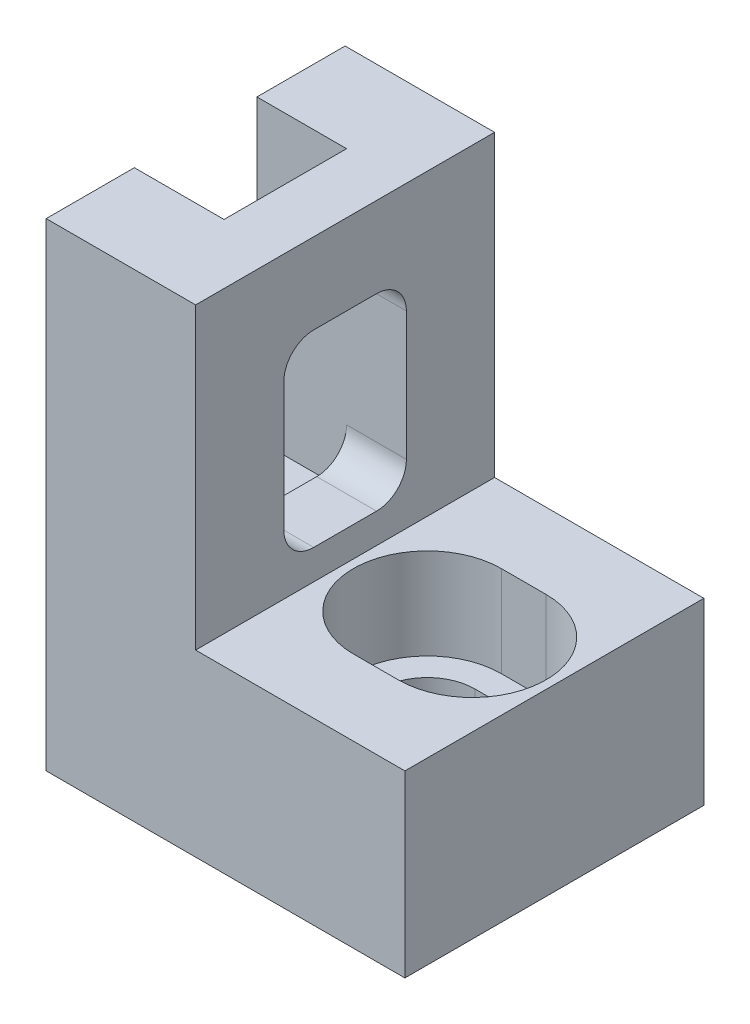
ISO-10303-21;
HEADER;
FILE_DESCRIPTION(('STEP AP214'),'2;1');
FILE_NAME('part.step','',(''),(''),'','','');
FILE_SCHEMA(('AUTOMOTIVE_DESIGN { 1 0 10303 214 1 1 1 1 }'));
ENDSEC;
DATA;
#1=APPLICATION_CONTEXT('core data for automotive mechanical design processes');
#2=APPLICATION_PROTOCOL_DEFINITION('international standard','automotive_design',2000,#1);
#3=PRODUCT_CONTEXT('',#1,'mechanical');
#4=PRODUCT('Part','Part','',(#3));
#5=PRODUCT_RELATED_PRODUCT_CATEGORY('part','',(#4));
#6=PRODUCT_DEFINITION_FORMATION('','',#4);
#7=PRODUCT_DEFINITION_CONTEXT('part definition',#1,'design');
#8=PRODUCT_DEFINITION('design','',#6,#7);
#9=PRODUCT_DEFINITION_SHAPE('','',#8);
#10=(LENGTH_UNIT() NAMED_UNIT(*) SI_UNIT(.MILLI.,.METRE.));
#11=(NAMED_UNIT(*) PLANE_ANGLE_UNIT() SI_UNIT($,.RADIAN.));
#12=(NAMED_UNIT(*) SI_UNIT($,.STERADIAN.) SOLID_ANGLE_UNIT());
#13=UNCERTAINTY_MEASURE_WITH_UNIT(LENGTH_MEASURE(1.E-05),#10,'distance_accuracy_value','');
#14=(GEOMETRIC_REPRESENTATION_CONTEXT(3) GLOBAL_UNCERTAINTY_ASSIGNED_CONTEXT((#13)) GLOBAL_UNIT_ASSIGNED_CONTEXT((#10,
#11,#12)) REPRESENTATION_CONTEXT('',''));
#15=CARTESIAN_POINT('',(0.,0.,0.));
#16=DIRECTION('',(0.,0.,1.));
#17=DIRECTION('',(1.,0.,0.));
#18=AXIS2_PLACEMENT_3D('',#15,#16,#17);
#19=CARTESIAN_POINT('',(12.,6.27872340425532,0.));
#20=DIRECTION('',(0.,-1.,0.));
#21=DIRECTION('',(0.,0.,-1.));
#22=AXIS2_PLACEMENT_3D('',#19,#20,#21);
#23=PLANE('',#22);
#24=DIRECTION('',(-1.,0.,0.));
#25=VECTOR('',#24,1.);
#26=CARTESIAN_POINT('',(0.,6.27872340425532,0.385106382978728));
#27=LINE('',#26,#25);
#28=CARTESIAN_POINT('',(5.,6.27872340425532,0.385106382978727));
#29=VERTEX_POINT('',#28);
#30=CARTESIAN_POINT('',(3.,6.27872340425532,0.385106382978728));
#31=VERTEX_POINT('',#30);
#32=EDGE_CURVE('E468',#29,#31,#27,.T.);
#33=ORIENTED_EDGE('',*,*,#32,.T.);
#34=DIRECTION('',(0.,0.,-1.));
#35=VECTOR('',#34,1.);
#36=CARTESIAN_POINT('',(3.,6.27872340425532,0.));
#37=LINE('',#36,#35);
#38=CARTESIAN_POINT('',(3.,6.27872340425532,-1.71489361702127));
#39=VERTEX_POINT('',#38);
#40=EDGE_CURVE('E267',#31,#39,#37,.T.);
#41=ORIENTED_EDGE('',*,*,#40,.T.);
#42=DIRECTION('',(-1.,0.,0.));
#43=VECTOR('',#42,1.);
#44=CARTESIAN_POINT('',(12.,6.27872340425532,-1.71489361702127));
#45=LINE('',#44,#43);
#46=CARTESIAN_POINT('',(5.,6.27872340425532,-1.71489361702127));
#47=VERTEX_POINT('',#46);
#48=EDGE_CURVE('E465',#39,#47,#45,.F.);
#49=ORIENTED_EDGE('',*,*,#48,.T.);
#50=DIRECTION('',(0.,0.,1.));
#51=VECTOR('',#50,1.);
#52=CARTESIAN_POINT('',(5.,6.27872340425532,-5.66489361702127));
#53=LINE('',#52,#51);
#54=EDGE_CURVE('E443',#47,#29,#53,.T.);
#55=ORIENTED_EDGE('',*,*,#54,.T.);
#56=EDGE_LOOP('',(#33,#41,#49,#55));
#57=FACE_BOUND('',#56,.T.);
#58=ADVANCED_FACE('F39',(#57),#23,.T.);
#59=CARTESIAN_POINT('',(12.,-0.0212765957446825,0.));
#60=DIRECTION('',(0.,-1.,0.));
#61=DIRECTION('',(0.,0.,-1.));
#62=AXIS2_PLACEMENT_3D('',#59,#60,#61);
#63=PLANE('',#62);
#64=DIRECTION('',(0.,0.,-1.));
#65=VECTOR('',#64,1.);
#66=CARTESIAN_POINT('',(3.,-0.0212765957446825,0.));
#67=LINE('',#66,#65);
#68=CARTESIAN_POINT('',(3.,-0.0212765957446825,0.385106382978727));
#69=VERTEX_POINT('',#68);
#70=CARTESIAN_POINT('',(3.,-0.0212765957446825,-1.71489361702127));
#71=VERTEX_POINT('',#70);
#72=EDGE_CURVE('E62',#69,#71,#67,.T.);
#73=ORIENTED_EDGE('',*,*,#72,.F.);
#74=DIRECTION('',(-1.,0.,0.));
#75=VECTOR('',#74,1.);
#76=CARTESIAN_POINT('',(12.,-0.0212765957446825,0.385106382978727));
#77=LINE('',#76,#75);
#78=CARTESIAN_POINT('',(5.,-0.0212765957446816,0.385106382978727));
#79=VERTEX_POINT('',#78);
#80=EDGE_CURVE('E462',#69,#79,#77,.F.);
#81=ORIENTED_EDGE('',*,*,#80,.T.);
#82=DIRECTION('',(0.,0.,1.));
#83=VECTOR('',#82,1.);
#84=CARTESIAN_POINT('',(5.,-0.0212765957446816,-5.66489361702127));
#85=LINE('',#84,#83);
#86=CARTESIAN_POINT('',(5.,-0.0212765957446816,-1.71489361702127));
#87=VERTEX_POINT('',#86);
#88=EDGE_CURVE('E435',#87,#79,#85,.T.);
#89=ORIENTED_EDGE('',*,*,#88,.F.);
#90=DIRECTION('',(-1.,0.,0.));
#91=VECTOR('',#90,1.);
#92=CARTESIAN_POINT('',(0.,-0.0212765957446825,-1.71489361702127));
#93=LINE('',#92,#91);
#94=EDGE_CURVE('E458',#87,#71,#93,.T.);
#95=ORIENTED_EDGE('',*,*,#94,.T.);
#96=EDGE_LOOP('',(#73,#81,#89,#95));
#97=FACE_BOUND('',#96,.T.);
#98=ADVANCED_FACE('F499',(#97),#63,.F.);
#99=CARTESIAN_POINT('',(12.,0.978723404255317,0.385106382978727));
#100=DIRECTION('',(-1.,0.,0.));
#101=DIRECTION('',(0.,0.,1.));
#102=AXIS2_PLACEMENT_3D('',#99,#100,#101);
#103=CYLINDRICAL_SURFACE('',#102,1.);
#104=CARTESIAN_POINT('',(3.,0.978723404255317,0.385106382978727));
#105=DIRECTION('',(-1.,0.,0.));
#106=DIRECTION('',(0.,0.,1.));
#107=AXIS2_PLACEMENT_3D('',#104,#105,#106);
#108=CIRCLE('',#107,1.);
#109=CARTESIAN_POINT('',(3.,0.978723404255317,1.38510638297873));
#110=VERTEX_POINT('',#109);
#111=EDGE_CURVE('E261',#110,#69,#108,.F.);
#112=ORIENTED_EDGE('',*,*,#111,.F.);
#113=DIRECTION('',(-1.,0.,0.));
#114=VECTOR('',#113,1.);
#115=CARTESIAN_POINT('',(12.,0.978723404255317,1.38510638297873));
#116=LINE('',#115,#114);
#117=CARTESIAN_POINT('',(5.,0.978723404255317,1.38510638297873));
#118=VERTEX_POINT('',#117);
#119=EDGE_CURVE('E454',#118,#110,#116,.T.);
#120=ORIENTED_EDGE('',*,*,#119,.F.);
#121=CARTESIAN_POINT('',(5.,0.978723404255317,0.385106382978727));
#122=DIRECTION('',(-1.,0.,0.));
#123=DIRECTION('',(0.,-1.,0.));
#124=AXIS2_PLACEMENT_3D('',#121,#122,#123);
#125=CIRCLE('',#124,1.);
#126=EDGE_CURVE('E479',#79,#118,#125,.T.);
#127=ORIENTED_EDGE('',*,*,#126,.F.);
#128=ORIENTED_EDGE('',*,*,#80,.F.);
#129=EDGE_LOOP('',(#112,#120,#127,#128));
#130=FACE_BOUND('',#129,.T.);
#131=ADVANCED_FACE('F568',(#130),#103,.F.);
#132=CARTESIAN_POINT('',(12.,5.27872340425532,0.385106382978728));
#133=DIRECTION('',(1.,0.,0.));
#134=DIRECTION('',(0.,0.,-1.));
#135=AXIS2_PLACEMENT_3D('',#132,#133,#134);
#136=CYLINDRICAL_SURFACE('',#135,1.);
#137=CARTESIAN_POINT('',(3.,5.27872340425532,0.385106382978728));
#138=DIRECTION('',(-1.,0.,0.));
#139=DIRECTION('',(0.,0.,1.));
#140=AXIS2_PLACEMENT_3D('',#137,#138,#139);
#141=CIRCLE('',#140,1.);
#142=CARTESIAN_POINT('',(3.,5.27872340425532,1.38510638297873));
#143=VERTEX_POINT('',#142);
#144=EDGE_CURVE('E271',#31,#143,#141,.F.);
#145=ORIENTED_EDGE('',*,*,#144,.F.);
#146=ORIENTED_EDGE('',*,*,#32,.F.);
#147=CARTESIAN_POINT('',(5.,5.27872340425532,0.385106382978728));
#148=DIRECTION('',(-1.,0.,0.));
#149=DIRECTION('',(0.,-1.,0.));
#150=AXIS2_PLACEMENT_3D('',#147,#148,#149);
#151=CIRCLE('',#150,1.);
#152=CARTESIAN_POINT('',(5.,5.27872340425532,1.38510638297873));
#153=VERTEX_POINT('',#152);
#154=EDGE_CURVE('E482',#153,#29,#151,.T.);
#155=ORIENTED_EDGE('',*,*,#154,.F.);
#156=DIRECTION('',(-1.,0.,0.));
#157=VECTOR('',#156,1.);
#158=CARTESIAN_POINT('',(5.,5.27872340425532,1.38510638297873));
#159=LINE('',#158,#157);
#160=EDGE_CURVE('E451',#143,#153,#159,.F.);
#161=ORIENTED_EDGE('',*,*,#160,.F.);
#162=EDGE_LOOP('',(#145,#146,#155,#161));
#163=FACE_BOUND('',#162,.T.);
#164=ADVANCED_FACE('F512',(#163),#136,.F.);
#165=CARTESIAN_POINT('',(12.,5.27872340425532,-1.71489361702127));
#166=DIRECTION('',(-1.,0.,0.));
#167=DIRECTION('',(0.,0.,1.));
#168=AXIS2_PLACEMENT_3D('',#165,#166,#167);
#169=CYLINDRICAL_SURFACE('',#168,1.);
#170=CARTESIAN_POINT('',(3.,5.27872340425532,-1.71489361702127));
#171=DIRECTION('',(-1.,0.,0.));
#172=DIRECTION('',(0.,0.,1.));
#173=AXIS2_PLACEMENT_3D('',#170,#171,#172);
#174=CIRCLE('',#173,1.);
#175=CARTESIAN_POINT('',(3.,5.27872340425532,-2.71489361702127));
#176=VERTEX_POINT('',#175);
#177=EDGE_CURVE('E264',#176,#39,#174,.F.);
#178=ORIENTED_EDGE('',*,*,#177,.F.);
#179=DIRECTION('',(-1.,0.,0.));
#180=VECTOR('',#179,1.);
#181=CARTESIAN_POINT('',(12.,5.27872340425532,-2.71489361702127));
#182=LINE('',#181,#180);
#183=CARTESIAN_POINT('',(5.,5.27872340425532,-2.71489361702127));
#184=VERTEX_POINT('',#183);
#185=EDGE_CURVE('E475',#184,#176,#182,.T.);
#186=ORIENTED_EDGE('',*,*,#185,.F.);
#187=CARTESIAN_POINT('',(5.,5.27872340425532,-1.71489361702127));
#188=DIRECTION('',(-1.,0.,0.));
#189=DIRECTION('',(0.,-1.,0.));
#190=AXIS2_PLACEMENT_3D('',#187,#188,#189);
#191=CIRCLE('',#190,1.);
#192=EDGE_CURVE('E485',#47,#184,#191,.T.);
#193=ORIENTED_EDGE('',*,*,#192,.F.);
#194=ORIENTED_EDGE('',*,*,#48,.F.);
#195=EDGE_LOOP('',(#178,#186,#193,#194));
#196=FACE_BOUND('',#195,.T.);
#197=ADVANCED_FACE('F504',(#196),#169,.F.);
#198=CARTESIAN_POINT('',(12.,0.978723404255317,-1.71489361702127));
#199=DIRECTION('',(1.,0.,0.));
#200=DIRECTION('',(0.,0.,-1.));
#201=AXIS2_PLACEMENT_3D('',#198,#199,#200);
#202=CYLINDRICAL_SURFACE('',#201,1.);
#203=CARTESIAN_POINT('',(3.,0.978723404255317,-1.71489361702127));
#204=DIRECTION('',(-1.,0.,0.));
#205=DIRECTION('',(0.,0.,1.));
#206=AXIS2_PLACEMENT_3D('',#203,#204,#205);
#207=CIRCLE('',#206,1.);
#208=CARTESIAN_POINT('',(3.,0.978723404255317,-2.71489361702127));
#209=VERTEX_POINT('',#208);
#210=EDGE_CURVE('E11',#71,#209,#207,.F.);
#211=ORIENTED_EDGE('',*,*,#210,.F.);
#212=ORIENTED_EDGE('',*,*,#94,.F.);
#213=CARTESIAN_POINT('',(5.,0.978723404255317,-1.71489361702127));
#214=DIRECTION('',(-1.,0.,0.));
#215=DIRECTION('',(0.,-1.,0.));
#216=AXIS2_PLACEMENT_3D('',#213,#214,#215);
#217=CIRCLE('',#216,1.);
#218=CARTESIAN_POINT('',(5.,0.978723404255317,-2.71489361702127));
#219=VERTEX_POINT('',#218);
#220=EDGE_CURVE('E48',#219,#87,#217,.T.);
#221=ORIENTED_EDGE('',*,*,#220,.F.);
#222=DIRECTION('',(-1.,0.,0.));
#223=VECTOR('',#222,1.);
#224=CARTESIAN_POINT('',(5.,0.978723404255317,-2.71489361702127));
#225=LINE('',#224,#223);
#226=EDGE_CURVE('E472',#209,#219,#225,.F.);
#227=ORIENTED_EDGE('',*,*,#226,.F.);
#228=EDGE_LOOP('',(#211,#212,#221,#227));
#229=FACE_BOUND('',#228,.T.);
#230=ADVANCED_FACE('F41',(#229),#202,.F.);
#231=CARTESIAN_POINT('',(0.,-7.02127659574468,-2.25489361702127));
#232=DIRECTION('',(0.,0.,-1.));
#233=DIRECTION('',(-1.,0.,0.));
#234=AXIS2_PLACEMENT_3D('',#231,#232,#233);
#235=PLANE('',#234);
#236=DIRECTION('',(-1.,0.,0.));
#237=VECTOR('',#236,1.);
#238=CARTESIAN_POINT('',(0.,-4.06607659574468,-2.25489361702127));
#239=LINE('',#238,#237);
#240=CARTESIAN_POINT('',(9.25,-4.06607659574468,-2.25489361702127));
#241=VERTEX_POINT('',#240);
#242=CARTESIAN_POINT('',(7.75,-4.06607659574468,-2.25489361702127));
#243=VERTEX_POINT('',#242);
#244=EDGE_CURVE('E307',#241,#243,#239,.T.);
#245=ORIENTED_EDGE('',*,*,#244,.T.);
#246=DIRECTION('',(0.,1.,0.));
#247=VECTOR('',#246,1.);
#248=CARTESIAN_POINT('',(7.75,-7.02127659574468,-2.25489361702127));
#249=LINE('',#248,#247);
#250=CARTESIAN_POINT('',(7.75,-7.02127659574468,-2.25489361702127));
#251=VERTEX_POINT('',#250);
#252=EDGE_CURVE('E353',#251,#243,#249,.T.);
#253=ORIENTED_EDGE('',*,*,#252,.F.);
#254=DIRECTION('',(-1.,0.,0.));
#255=VECTOR('',#254,1.);
#256=CARTESIAN_POINT('',(0.,-7.02127659574468,-2.25489361702127));
#257=LINE('',#256,#255);
#258=CARTESIAN_POINT('',(9.25,-7.02127659574468,-2.25489361702127));
#259=VERTEX_POINT('',#258);
#260=EDGE_CURVE('E328',#259,#251,#257,.T.);
#261=ORIENTED_EDGE('',*,*,#260,.F.);
#262=DIRECTION('',(0.,1.,0.));
#263=VECTOR('',#262,1.);
#264=CARTESIAN_POINT('',(9.25,-7.02127659574468,-2.25489361702127));
#265=LINE('',#264,#263);
#266=EDGE_CURVE('E354',#259,#241,#265,.T.);
#267=ORIENTED_EDGE('',*,*,#266,.T.);
#268=EDGE_LOOP('',(#245,#253,#261,#267));
#269=FACE_BOUND('',#268,.T.);
#270=ADVANCED_FACE('F596',(#269),#235,.F.);
#271=CARTESIAN_POINT('',(9.25,-7.02127659574468,-0.664893617021274));
#272=DIRECTION('',(0.,1.,0.));
#273=DIRECTION('',(-1.,0.,0.));
#274=AXIS2_PLACEMENT_3D('',#271,#272,#273);
#275=CYLINDRICAL_SURFACE('',#274,1.59);
#276=CARTESIAN_POINT('',(9.25,-4.06607659574468,-0.664893617021274));
#277=DIRECTION('',(0.,1.,0.));
#278=DIRECTION('',(-1.,0.,0.));
#279=AXIS2_PLACEMENT_3D('',#276,#277,#278);
#280=CIRCLE('',#279,1.59);
#281=CARTESIAN_POINT('',(9.25,-4.06607659574468,0.925106382978726));
#282=VERTEX_POINT('',#281);
#283=EDGE_CURVE('E296',#282,#241,#280,.T.);
#284=ORIENTED_EDGE('',*,*,#283,.T.);
#285=ORIENTED_EDGE('',*,*,#266,.F.);
#286=CARTESIAN_POINT('',(9.25,-7.02127659574468,-0.664893617021274));
#287=DIRECTION('',(0.,1.,0.));
#288=DIRECTION('',(-1.,0.,0.));
#289=AXIS2_PLACEMENT_3D('',#286,#287,#288);
#290=CIRCLE('',#289,1.59);
#291=CARTESIAN_POINT('',(9.25,-7.02127659574468,0.925106382978726));
#292=VERTEX_POINT('',#291);
#293=EDGE_CURVE('E349',#292,#259,#290,.T.);
#294=ORIENTED_EDGE('',*,*,#293,.F.);
#295=DIRECTION('',(0.,1.,0.));
#296=VECTOR('',#295,1.);
#297=CARTESIAN_POINT('',(9.25,-7.02127659574468,0.925106382978726));
#298=LINE('',#297,#296);
#299=EDGE_CURVE('E359',#292,#282,#298,.T.);
#300=ORIENTED_EDGE('',*,*,#299,.T.);
#301=EDGE_LOOP('',(#284,#285,#294,#300));
#302=FACE_BOUND('',#301,.T.);
#303=ADVANCED_FACE('F592',(#302),#275,.F.);
#304=CARTESIAN_POINT('',(0.,-7.02127659574468,0.925106382978727));
#305=DIRECTION('',(0.,0.,-1.));
#306=DIRECTION('',(-1.,0.,0.));
#307=AXIS2_PLACEMENT_3D('',#304,#305,#306);
#308=PLANE('',#307);
#309=DIRECTION('',(0.,1.,0.));
#310=VECTOR('',#309,1.);
#311=CARTESIAN_POINT('',(7.75,-7.02127659574468,0.925106382978726));
#312=LINE('',#311,#310);
#313=CARTESIAN_POINT('',(7.75,-7.02127659574468,0.925106382978726));
#314=VERTEX_POINT('',#313);
#315=CARTESIAN_POINT('',(7.75,-4.06607659574468,0.925106382978726));
#316=VERTEX_POINT('',#315);
#317=EDGE_CURVE('E363',#314,#316,#312,.T.);
#318=ORIENTED_EDGE('',*,*,#317,.T.);
#319=DIRECTION('',(-1.,0.,0.));
#320=VECTOR('',#319,1.);
#321=CARTESIAN_POINT('',(0.,-4.06607659574468,0.925106382978727));
#322=LINE('',#321,#320);
#323=EDGE_CURVE('E300',#282,#316,#322,.T.);
#324=ORIENTED_EDGE('',*,*,#323,.F.);
#325=ORIENTED_EDGE('',*,*,#299,.F.);
#326=DIRECTION('',(-1.,0.,0.));
#327=VECTOR('',#326,1.);
#328=CARTESIAN_POINT('',(0.,-7.02127659574468,0.925106382978727));
#329=LINE('',#328,#327);
#330=EDGE_CURVE('E345',#292,#314,#329,.T.);
#331=ORIENTED_EDGE('',*,*,#330,.T.);
#332=EDGE_LOOP('',(#318,#324,#325,#331));
#333=FACE_BOUND('',#332,.T.);
#334=ADVANCED_FACE('F595',(#333),#308,.T.);
#335=CARTESIAN_POINT('',(7.75,-7.02127659574468,-0.664893617021274));
#336=DIRECTION('',(0.,1.,0.));
#337=DIRECTION('',(-1.,0.,0.));
#338=AXIS2_PLACEMENT_3D('',#335,#336,#337);
#339=CYLINDRICAL_SURFACE('',#338,1.59);
#340=CARTESIAN_POINT('',(7.75,-4.06607659574468,-0.664893617021274));
#341=DIRECTION('',(0.,1.,0.));
#342=DIRECTION('',(-1.,0.,0.));
#343=AXIS2_PLACEMENT_3D('',#340,#341,#342);
#344=CIRCLE('',#343,1.59);
#345=EDGE_CURVE('E303',#243,#316,#344,.T.);
#346=ORIENTED_EDGE('',*,*,#345,.T.);
#347=ORIENTED_EDGE('',*,*,#317,.F.);
#348=CARTESIAN_POINT('',(7.75,-7.02127659574468,-0.664893617021274));
#349=DIRECTION('',(0.,1.,0.));
#350=DIRECTION('',(-1.,0.,0.));
#351=AXIS2_PLACEMENT_3D('',#348,#349,#350);
#352=CIRCLE('',#351,1.59);
#353=EDGE_CURVE('E341',#251,#314,#352,.T.);
#354=ORIENTED_EDGE('',*,*,#353,.F.);
#355=ORIENTED_EDGE('',*,*,#252,.T.);
#356=EDGE_LOOP('',(#346,#347,#354,#355));
#357=FACE_BOUND('',#356,.T.);
#358=ADVANCED_FACE('F600',(#357),#339,.F.);
#359=CARTESIAN_POINT('',(12.,8.97872340425532,4.33510638297873));
#360=DIRECTION('',(0.,0.,-1.));
#361=DIRECTION('',(0.,1.,0.));
#362=AXIS2_PLACEMENT_3D('',#359,#360,#361);
#363=PLANE('',#362);
#364=DIRECTION('',(0.,-1.,0.));
#365=VECTOR('',#364,1.);
#366=CARTESIAN_POINT('',(12.,8.97872340425532,4.33510638297873));
#367=LINE('',#366,#365);
#368=CARTESIAN_POINT('',(12.,-1.02127659574468,4.33510638297873));
#369=VERTEX_POINT('',#368);
#370=CARTESIAN_POINT('',(12.,-7.02127659574468,4.33510638297872));
#371=VERTEX_POINT('',#370);
#372=EDGE_CURVE('E395',#369,#371,#367,.T.);
#373=ORIENTED_EDGE('',*,*,#372,.F.);
#374=DIRECTION('',(1.,0.,0.));
#375=VECTOR('',#374,1.);
#376=CARTESIAN_POINT('',(12.,-1.02127659574468,4.33510638297873));
#377=LINE('',#376,#375);
#378=CARTESIAN_POINT('',(5.,-1.02127659574468,4.33510638297873));
#379=VERTEX_POINT('',#378);
#380=EDGE_CURVE('E375',#379,#369,#377,.T.);
#381=ORIENTED_EDGE('',*,*,#380,.F.);
#382=DIRECTION('',(0.,-1.,0.));
#383=VECTOR('',#382,1.);
#384=CARTESIAN_POINT('',(5.,8.97872340425532,4.33510638297873));
#385=LINE('',#384,#383);
#386=CARTESIAN_POINT('',(5.,8.97872340425532,4.33510638297873));
#387=VERTEX_POINT('',#386);
#388=EDGE_CURVE('E358',#387,#379,#385,.T.);
#389=ORIENTED_EDGE('',*,*,#388,.F.);
#390=DIRECTION('',(-1.,0.,0.));
#391=VECTOR('',#390,1.);
#392=CARTESIAN_POINT('',(12.,8.97872340425532,4.33510638297873));
#393=LINE('',#392,#391);
#394=CARTESIAN_POINT('',(0.,8.97872340425532,4.33510638297873));
#395=VERTEX_POINT('',#394);
#396=EDGE_CURVE('E406',#387,#395,#393,.T.);
#397=ORIENTED_EDGE('',*,*,#396,.T.);
#398=DIRECTION('',(0.,-1.,0.));
#399=VECTOR('',#398,1.);
#400=CARTESIAN_POINT('',(0.,8.97872340425532,4.33510638297873));
#401=LINE('',#400,#399);
#402=CARTESIAN_POINT('',(0.,-7.02127659574468,4.33510638297872));
#403=VERTEX_POINT('',#402);
#404=EDGE_CURVE('E389',#395,#403,#401,.T.);
#405=ORIENTED_EDGE('',*,*,#404,.T.);
#406=DIRECTION('',(-1.,0.,0.));
#407=VECTOR('',#406,1.);
#408=CARTESIAN_POINT('',(12.,-7.02127659574468,4.33510638297872));
#409=LINE('',#408,#407);
#410=EDGE_CURVE('E431',#371,#403,#409,.T.);
#411=ORIENTED_EDGE('',*,*,#410,.F.);
#412=EDGE_LOOP('',(#373,#381,#389,#397,#405,#411));
#413=FACE_BOUND('',#412,.T.);
#414=ADVANCED_FACE('F532',(#413),#363,.F.);
#415=CARTESIAN_POINT('',(12.,-7.02127659574468,4.33510638297872));
#416=DIRECTION('',(0.,1.,0.));
#417=DIRECTION('',(0.,0.,1.));
#418=AXIS2_PLACEMENT_3D('',#415,#416,#417);
#419=PLANE('',#418);
#420=ORIENTED_EDGE('',*,*,#293,.T.);
#421=ORIENTED_EDGE('',*,*,#260,.T.);
#422=ORIENTED_EDGE('',*,*,#353,.T.);
#423=ORIENTED_EDGE('',*,*,#330,.F.);
#424=EDGE_LOOP('',(#420,#421,#422,#423));
#425=FACE_BOUND('',#424,.T.);
#426=DIRECTION('',(0.,0.,-1.));
#427=VECTOR('',#426,1.);
#428=CARTESIAN_POINT('',(0.,-7.02127659574468,4.33510638297872));
#429=LINE('',#428,#427);
#430=CARTESIAN_POINT('',(0.,-7.02127659574468,-5.66489361702127));
#431=VERTEX_POINT('',#430);
#432=EDGE_CURVE('E410',#403,#431,#429,.T.);
#433=ORIENTED_EDGE('',*,*,#432,.T.);
#434=DIRECTION('',(-1.,0.,0.));
#435=VECTOR('',#434,1.);
#436=CARTESIAN_POINT('',(12.,-7.02127659574468,-5.66489361702127));
#437=LINE('',#436,#435);
#438=CARTESIAN_POINT('',(12.,-7.02127659574468,-5.66489361702127));
#439=VERTEX_POINT('',#438);
#440=EDGE_CURVE('E427',#439,#431,#437,.T.);
#441=ORIENTED_EDGE('',*,*,#440,.F.);
#442=DIRECTION('',(0.,0.,-1.));
#443=VECTOR('',#442,1.);
#444=CARTESIAN_POINT('',(12.,-7.02127659574468,4.33510638297872));
#445=LINE('',#444,#443);
#446=EDGE_CURVE('E398',#371,#439,#445,.T.);
#447=ORIENTED_EDGE('',*,*,#446,.F.);
#448=ORIENTED_EDGE('',*,*,#410,.T.);
#449=EDGE_LOOP('',(#433,#441,#447,#448));
#450=FACE_BOUND('',#449,.T.);
#451=ADVANCED_FACE('F544',(#425,#450),#419,.F.);
#452=CARTESIAN_POINT('',(12.,8.97872340425532,-5.66489361702127));
#453=DIRECTION('',(0.,0.,1.));
#454=DIRECTION('',(0.,-1.,0.));
#455=AXIS2_PLACEMENT_3D('',#452,#453,#454);
#456=PLANE('',#455);
#457=DIRECTION('',(0.,-1.,0.));
#458=VECTOR('',#457,1.);
#459=CARTESIAN_POINT('',(5.,8.97872340425532,-5.66489361702127));
#460=LINE('',#459,#458);
#461=CARTESIAN_POINT('',(5.,8.97872340425532,-5.66489361702127));
#462=VERTEX_POINT('',#461);
#463=CARTESIAN_POINT('',(5.,-1.02127659574468,-5.66489361702127));
#464=VERTEX_POINT('',#463);
#465=EDGE_CURVE('E370',#462,#464,#460,.T.);
#466=ORIENTED_EDGE('',*,*,#465,.T.);
#467=DIRECTION('',(1.,0.,0.));
#468=VECTOR('',#467,1.);
#469=CARTESIAN_POINT('',(12.,-1.02127659574468,-5.66489361702127));
#470=LINE('',#469,#468);
#471=CARTESIAN_POINT('',(12.,-1.02127659574468,-5.66489361702127));
#472=VERTEX_POINT('',#471);
#473=EDGE_CURVE('E374',#464,#472,#470,.T.);
#474=ORIENTED_EDGE('',*,*,#473,.T.);
#475=DIRECTION('',(0.,1.,0.));
#476=VECTOR('',#475,1.);
#477=CARTESIAN_POINT('',(12.,8.97872340425532,-5.66489361702127));
#478=LINE('',#477,#476);
#479=EDGE_CURVE('E402',#439,#472,#478,.T.);
#480=ORIENTED_EDGE('',*,*,#479,.F.);
#481=ORIENTED_EDGE('',*,*,#440,.T.);
#482=DIRECTION('',(0.,1.,0.));
#483=VECTOR('',#482,1.);
#484=CARTESIAN_POINT('',(0.,8.97872340425532,-5.66489361702127));
#485=LINE('',#484,#483);
#486=CARTESIAN_POINT('',(0.,8.97872340425532,-5.66489361702127));
#487=VERTEX_POINT('',#486);
#488=EDGE_CURVE('E413',#431,#487,#485,.T.);
#489=ORIENTED_EDGE('',*,*,#488,.T.);
#490=DIRECTION('',(-1.,0.,0.));
#491=VECTOR('',#490,1.);
#492=CARTESIAN_POINT('',(12.,8.97872340425532,-5.66489361702127));
#493=LINE('',#492,#491);
#494=EDGE_CURVE('E424',#462,#487,#493,.T.);
#495=ORIENTED_EDGE('',*,*,#494,.F.);
#496=EDGE_LOOP('',(#466,#474,#480,#481,#489,#495));
#497=FACE_BOUND('',#496,.T.);
#498=ADVANCED_FACE('F538',(#497),#456,.F.);
#499=CARTESIAN_POINT('',(12.,8.97872340425532,4.33510638297873));
#500=DIRECTION('',(0.,-1.,0.));
#501=DIRECTION('',(0.,0.,-1.));
#502=AXIS2_PLACEMENT_3D('',#499,#500,#501);
#503=PLANE('',#502);
#504=DIRECTION('',(0.,0.,1.));
#505=VECTOR('',#504,1.);
#506=CARTESIAN_POINT('',(0.,8.97872340425532,4.33510638297873));
#507=LINE('',#506,#505);
#508=CARTESIAN_POINT('',(0.,8.97872340425532,-2.71489361702127));
#509=VERTEX_POINT('',#508);
#510=EDGE_CURVE('E399',#487,#509,#507,.T.);
#511=ORIENTED_EDGE('',*,*,#510,.T.);
#512=DIRECTION('',(-1.,0.,0.));
#513=VECTOR('',#512,1.);
#514=CARTESIAN_POINT('',(3.,8.97872340425532,-2.71489361702127));
#515=LINE('',#514,#513);
#516=CARTESIAN_POINT('',(3.,8.97872340425532,-2.71489361702127));
#517=VERTEX_POINT('',#516);
#518=EDGE_CURVE('E250',#517,#509,#515,.T.);
#519=ORIENTED_EDGE('',*,*,#518,.F.);
#520=DIRECTION('',(0.,0.,-1.));
#521=VECTOR('',#520,1.);
#522=CARTESIAN_POINT('',(3.,8.97872340425532,0.));
#523=LINE('',#522,#521);
#524=CARTESIAN_POINT('',(3.,8.97872340425532,1.38510638297873));
#525=VERTEX_POINT('',#524);
#526=EDGE_CURVE('E231',#525,#517,#523,.T.);
#527=ORIENTED_EDGE('',*,*,#526,.F.);
#528=DIRECTION('',(-1.,0.,0.));
#529=VECTOR('',#528,1.);
#530=CARTESIAN_POINT('',(3.,8.97872340425532,1.38510638297873));
#531=LINE('',#530,#529);
#532=CARTESIAN_POINT('',(0.,8.97872340425532,1.38510638297873));
#533=VERTEX_POINT('',#532);
#534=EDGE_CURVE('E253',#525,#533,#531,.T.);
#535=ORIENTED_EDGE('',*,*,#534,.T.);
#536=EDGE_CURVE('E417',#533,#395,#507,.T.);
#537=ORIENTED_EDGE('',*,*,#536,.T.);
#538=ORIENTED_EDGE('',*,*,#396,.F.);
#539=DIRECTION('',(0.,0.,1.));
#540=VECTOR('',#539,1.);
#541=CARTESIAN_POINT('',(5.,8.97872340425532,-5.66489361702127));
#542=LINE('',#541,#540);
#543=EDGE_CURVE('E379',#462,#387,#542,.T.);
#544=ORIENTED_EDGE('',*,*,#543,.F.);
#545=ORIENTED_EDGE('',*,*,#494,.T.);
#546=EDGE_LOOP('',(#511,#519,#527,#535,#537,#538,#544,#545));
#547=FACE_BOUND('',#546,.T.);
#548=ADVANCED_FACE('F521',(#547),#503,.F.);
#549=CARTESIAN_POINT('',(12.,0.,0.));
#550=DIRECTION('',(1.,0.,0.));
#551=DIRECTION('',(0.,0.,-1.));
#552=AXIS2_PLACEMENT_3D('',#549,#550,#551);
#553=PLANE('',#552);
#554=DIRECTION('',(0.,0.,1.));
#555=VECTOR('',#554,1.);
#556=CARTESIAN_POINT('',(12.,-1.02127659574468,-5.66489361702127));
#557=LINE('',#556,#555);
#558=EDGE_CURVE('E385',#472,#369,#557,.T.);
#559=ORIENTED_EDGE('',*,*,#558,.T.);
#560=ORIENTED_EDGE('',*,*,#372,.T.);
#561=ORIENTED_EDGE('',*,*,#446,.T.);
#562=ORIENTED_EDGE('',*,*,#479,.T.);
#563=EDGE_LOOP('',(#559,#560,#561,#562));
#564=FACE_BOUND('',#563,.T.);
#565=ADVANCED_FACE('F546',(#564),#553,.T.);
#566=CARTESIAN_POINT('',(0.,0.,0.));
#567=DIRECTION('',(1.,0.,0.));
#568=DIRECTION('',(0.,0.,-1.));
#569=AXIS2_PLACEMENT_3D('',#566,#567,#568);
#570=PLANE('',#569);
#571=DIRECTION('',(0.,-1.,0.));
#572=VECTOR('',#571,1.);
#573=CARTESIAN_POINT('',(0.,0.,-2.71489361702127));
#574=LINE('',#573,#572);
#575=CARTESIAN_POINT('',(0.,-0.946152886675879,-2.71489361702127));
#576=VERTEX_POINT('',#575);
#577=EDGE_CURVE('E225',#509,#576,#574,.T.);
#578=ORIENTED_EDGE('',*,*,#577,.F.);
#579=ORIENTED_EDGE('',*,*,#510,.F.);
#580=ORIENTED_EDGE('',*,*,#488,.F.);
#581=ORIENTED_EDGE('',*,*,#432,.F.);
#582=ORIENTED_EDGE('',*,*,#404,.F.);
#583=ORIENTED_EDGE('',*,*,#536,.F.);
#584=DIRECTION('',(0.,-1.,0.));
#585=VECTOR('',#584,1.);
#586=CARTESIAN_POINT('',(0.,0.,1.38510638297873));
#587=LINE('',#586,#585);
#588=CARTESIAN_POINT('',(0.,-0.946152886675879,1.38510638297873));
#589=VERTEX_POINT('',#588);
#590=EDGE_CURVE('E276',#533,#589,#587,.T.);
#591=ORIENTED_EDGE('',*,*,#590,.T.);
#592=DIRECTION('',(0.,0.,1.));
#593=VECTOR('',#592,1.);
#594=CARTESIAN_POINT('',(0.,-0.946152886675879,0.));
#595=LINE('',#594,#593);
#596=EDGE_CURVE('E219',#576,#589,#595,.T.);
#597=ORIENTED_EDGE('',*,*,#596,.F.);
#598=EDGE_LOOP('',(#578,#579,#580,#581,#582,#583,#591,#597));
#599=FACE_BOUND('',#598,.T.);
#600=ADVANCED_FACE('F526',(#599),#570,.F.);
#601=CARTESIAN_POINT('',(12.,-1.02127659574468,-5.66489361702127));
#602=DIRECTION('',(0.,-1.,0.));
#603=DIRECTION('',(1.,0.,0.));
#604=AXIS2_PLACEMENT_3D('',#601,#602,#603);
#605=PLANE('',#604);
#606=CARTESIAN_POINT('',(9.25,-1.02127659574468,-0.664893617021274));
#607=DIRECTION('',(0.,1.,0.));
#608=DIRECTION('',(-1.,0.,0.));
#609=AXIS2_PLACEMENT_3D('',#606,#607,#608);
#610=CIRCLE('',#609,2.4741);
#611=CARTESIAN_POINT('',(9.25,-1.02127659574468,1.80920638297873));
#612=VERTEX_POINT('',#611);
#613=CARTESIAN_POINT('',(9.25,-1.02127659574468,-3.13899361702127));
#614=VERTEX_POINT('',#613);
#615=EDGE_CURVE('E314',#612,#614,#610,.T.);
#616=ORIENTED_EDGE('',*,*,#615,.F.);
#617=DIRECTION('',(1.,0.,0.));
#618=VECTOR('',#617,1.);
#619=CARTESIAN_POINT('',(0.,-1.02127659574468,1.80920638297873));
#620=LINE('',#619,#618);
#621=CARTESIAN_POINT('',(7.75,-1.02127659574468,1.80920638297873));
#622=VERTEX_POINT('',#621);
#623=EDGE_CURVE('E279',#622,#612,#620,.T.);
#624=ORIENTED_EDGE('',*,*,#623,.F.);
#625=CARTESIAN_POINT('',(7.75,-1.02127659574468,-0.664893617021274));
#626=DIRECTION('',(0.,1.,0.));
#627=DIRECTION('',(-1.,0.,0.));
#628=AXIS2_PLACEMENT_3D('',#625,#626,#627);
#629=CIRCLE('',#628,2.4741);
#630=CARTESIAN_POINT('',(7.75,-1.02127659574468,-3.13899361702127));
#631=VERTEX_POINT('',#630);
#632=EDGE_CURVE('E285',#631,#622,#629,.T.);
#633=ORIENTED_EDGE('',*,*,#632,.F.);
#634=DIRECTION('',(1.,0.,0.));
#635=VECTOR('',#634,1.);
#636=CARTESIAN_POINT('',(0.,-1.02127659574468,-3.13899361702127));
#637=LINE('',#636,#635);
#638=EDGE_CURVE('E318',#631,#614,#637,.T.);
#639=ORIENTED_EDGE('',*,*,#638,.T.);
#640=EDGE_LOOP('',(#616,#624,#633,#639));
#641=FACE_BOUND('',#640,.T.);
#642=ORIENTED_EDGE('',*,*,#380,.T.);
#643=ORIENTED_EDGE('',*,*,#558,.F.);
#644=ORIENTED_EDGE('',*,*,#473,.F.);
#645=DIRECTION('',(0.,0.,1.));
#646=VECTOR('',#645,1.);
#647=CARTESIAN_POINT('',(5.,-1.02127659574468,-5.66489361702127));
#648=LINE('',#647,#646);
#649=EDGE_CURVE('E390',#464,#379,#648,.T.);
#650=ORIENTED_EDGE('',*,*,#649,.T.);
#651=EDGE_LOOP('',(#642,#643,#644,#650));
#652=FACE_BOUND('',#651,.T.);
#653=ADVANCED_FACE('F548',(#641,#652),#605,.F.);
#654=CARTESIAN_POINT('',(5.,8.97872340425532,-5.66489361702127));
#655=DIRECTION('',(-1.,0.,0.));
#656=DIRECTION('',(0.,-1.,0.));
#657=AXIS2_PLACEMENT_3D('',#654,#655,#656);
#658=PLANE('',#657);
#659=ORIENTED_EDGE('',*,*,#54,.F.);
#660=ORIENTED_EDGE('',*,*,#192,.T.);
#661=DIRECTION('',(0.,-1.,0.));
#662=VECTOR('',#661,1.);
#663=CARTESIAN_POINT('',(5.,8.97872340425532,-2.71489361702127));
#664=LINE('',#663,#662);
#665=EDGE_CURVE('E447',#184,#219,#664,.T.);
#666=ORIENTED_EDGE('',*,*,#665,.T.);
#667=ORIENTED_EDGE('',*,*,#220,.T.);
#668=ORIENTED_EDGE('',*,*,#88,.T.);
#669=ORIENTED_EDGE('',*,*,#126,.T.);
#670=DIRECTION('',(0.,-1.,0.));
#671=VECTOR('',#670,1.);
#672=CARTESIAN_POINT('',(5.,8.97872340425531,1.38510638297873));
#673=LINE('',#672,#671);
#674=EDGE_CURVE('E439',#153,#118,#673,.T.);
#675=ORIENTED_EDGE('',*,*,#674,.F.);
#676=ORIENTED_EDGE('',*,*,#154,.T.);
#677=EDGE_LOOP('',(#659,#660,#666,#667,#668,#669,#675,#676));
#678=FACE_BOUND('',#677,.T.);
#679=ORIENTED_EDGE('',*,*,#388,.T.);
#680=ORIENTED_EDGE('',*,*,#649,.F.);
#681=ORIENTED_EDGE('',*,*,#465,.F.);
#682=ORIENTED_EDGE('',*,*,#543,.T.);
#683=EDGE_LOOP('',(#679,#680,#681,#682));
#684=FACE_BOUND('',#683,.T.);
#685=ADVANCED_FACE('F492',(#678,#684),#658,.F.);
#686=CARTESIAN_POINT('',(0.,-4.06607659574468,1.80920638297873));
#687=DIRECTION('',(0.,0.,1.));
#688=DIRECTION('',(1.,0.,0.));
#689=AXIS2_PLACEMENT_3D('',#686,#687,#688);
#690=PLANE('',#689);
#691=ORIENTED_EDGE('',*,*,#623,.T.);
#692=DIRECTION('',(0.,1.,0.));
#693=VECTOR('',#692,1.);
#694=CARTESIAN_POINT('',(9.25,-4.06607659574468,1.80920638297873));
#695=LINE('',#694,#693);
#696=CARTESIAN_POINT('',(9.25,-4.06607659574468,1.80920638297873));
#697=VERTEX_POINT('',#696);
#698=EDGE_CURVE('E311',#697,#612,#695,.T.);
#699=ORIENTED_EDGE('',*,*,#698,.F.);
#700=DIRECTION('',(1.,0.,0.));
#701=VECTOR('',#700,1.);
#702=CARTESIAN_POINT('',(0.,-4.06607659574468,1.80920638297873));
#703=LINE('',#702,#701);
#704=CARTESIAN_POINT('',(7.75,-4.06607659574468,1.80920638297873));
#705=VERTEX_POINT('',#704);
#706=EDGE_CURVE('E280',#705,#697,#703,.T.);
#707=ORIENTED_EDGE('',*,*,#706,.F.);
#708=DIRECTION('',(0.,1.,0.));
#709=VECTOR('',#708,1.);
#710=CARTESIAN_POINT('',(7.75,-4.06607659574468,1.80920638297873));
#711=LINE('',#710,#709);
#712=EDGE_CURVE('E325',#705,#622,#711,.T.);
#713=ORIENTED_EDGE('',*,*,#712,.T.);
#714=EDGE_LOOP('',(#691,#699,#707,#713));
#715=FACE_BOUND('',#714,.T.);
#716=ADVANCED_FACE('F551',(#715),#690,.F.);
#717=CARTESIAN_POINT('',(7.75,-4.06607659574468,-0.664893617021274));
#718=DIRECTION('',(0.,1.,0.));
#719=DIRECTION('',(-1.,0.,0.));
#720=AXIS2_PLACEMENT_3D('',#717,#718,#719);
#721=CYLINDRICAL_SURFACE('',#720,2.4741);
#722=ORIENTED_EDGE('',*,*,#632,.T.);
#723=ORIENTED_EDGE('',*,*,#712,.F.);
#724=CARTESIAN_POINT('',(7.75,-4.06607659574468,-0.664893617021274));
#725=DIRECTION('',(0.,1.,0.));
#726=DIRECTION('',(-1.,0.,0.));
#727=AXIS2_PLACEMENT_3D('',#724,#725,#726);
#728=CIRCLE('',#727,2.4741);
#729=CARTESIAN_POINT('',(7.75,-4.06607659574468,-3.13899361702127));
#730=VERTEX_POINT('',#729);
#731=EDGE_CURVE('E292',#730,#705,#728,.T.);
#732=ORIENTED_EDGE('',*,*,#731,.F.);
#733=DIRECTION('',(0.,1.,0.));
#734=VECTOR('',#733,1.);
#735=CARTESIAN_POINT('',(7.75,-4.06607659574468,-3.13899361702127));
#736=LINE('',#735,#734);
#737=EDGE_CURVE('E329',#730,#631,#736,.T.);
#738=ORIENTED_EDGE('',*,*,#737,.T.);
#739=EDGE_LOOP('',(#722,#723,#732,#738));
#740=FACE_BOUND('',#739,.T.);
#741=ADVANCED_FACE('F557',(#740),#721,.F.);
#742=CARTESIAN_POINT('',(0.,-4.06607659574468,-3.13899361702127));
#743=DIRECTION('',(0.,0.,1.));
#744=DIRECTION('',(1.,0.,0.));
#745=AXIS2_PLACEMENT_3D('',#742,#743,#744);
#746=PLANE('',#745);
#747=ORIENTED_EDGE('',*,*,#638,.F.);
#748=ORIENTED_EDGE('',*,*,#737,.F.);
#749=DIRECTION('',(1.,0.,0.));
#750=VECTOR('',#749,1.);
#751=CARTESIAN_POINT('',(0.,-4.06607659574468,-3.13899361702127));
#752=LINE('',#751,#750);
#753=CARTESIAN_POINT('',(9.25,-4.06607659574468,-3.13899361702127));
#754=VERTEX_POINT('',#753);
#755=EDGE_CURVE('E289',#730,#754,#752,.T.);
#756=ORIENTED_EDGE('',*,*,#755,.T.);
#757=DIRECTION('',(0.,1.,0.));
#758=VECTOR('',#757,1.);
#759=CARTESIAN_POINT('',(9.25,-4.06607659574468,-3.13899361702127));
#760=LINE('',#759,#758);
#761=EDGE_CURVE('E332',#754,#614,#760,.T.);
#762=ORIENTED_EDGE('',*,*,#761,.T.);
#763=EDGE_LOOP('',(#747,#748,#756,#762));
#764=FACE_BOUND('',#763,.T.);
#765=ADVANCED_FACE('F584',(#764),#746,.T.);
#766=CARTESIAN_POINT('',(9.25,-4.06607659574468,-0.664893617021274));
#767=DIRECTION('',(0.,1.,0.));
#768=DIRECTION('',(-1.,0.,0.));
#769=AXIS2_PLACEMENT_3D('',#766,#767,#768);
#770=CYLINDRICAL_SURFACE('',#769,2.4741);
#771=ORIENTED_EDGE('',*,*,#615,.T.);
#772=ORIENTED_EDGE('',*,*,#761,.F.);
#773=CARTESIAN_POINT('',(9.25,-4.06607659574468,-0.664893617021274));
#774=DIRECTION('',(0.,1.,0.));
#775=DIRECTION('',(-1.,0.,0.));
#776=AXIS2_PLACEMENT_3D('',#773,#774,#775);
#777=CIRCLE('',#776,2.4741);
#778=EDGE_CURVE('E284',#697,#754,#777,.T.);
#779=ORIENTED_EDGE('',*,*,#778,.F.);
#780=ORIENTED_EDGE('',*,*,#698,.T.);
#781=EDGE_LOOP('',(#771,#772,#779,#780));
#782=FACE_BOUND('',#781,.T.);
#783=ADVANCED_FACE('F580',(#782),#770,.F.);
#784=CARTESIAN_POINT('',(0.,-4.06607659574468,0.));
#785=DIRECTION('',(0.,1.,0.));
#786=DIRECTION('',(-1.,0.,0.));
#787=AXIS2_PLACEMENT_3D('',#784,#785,#786);
#788=PLANE('',#787);
#789=ORIENTED_EDGE('',*,*,#706,.T.);
#790=ORIENTED_EDGE('',*,*,#778,.T.);
#791=ORIENTED_EDGE('',*,*,#755,.F.);
#792=ORIENTED_EDGE('',*,*,#731,.T.);
#793=EDGE_LOOP('',(#789,#790,#791,#792));
#794=FACE_BOUND('',#793,.T.);
#795=ORIENTED_EDGE('',*,*,#283,.F.);
#796=ORIENTED_EDGE('',*,*,#323,.T.);
#797=ORIENTED_EDGE('',*,*,#345,.F.);
#798=ORIENTED_EDGE('',*,*,#244,.F.);
#799=EDGE_LOOP('',(#795,#796,#797,#798));
#800=FACE_BOUND('',#799,.T.);
#801=ADVANCED_FACE('F577',(#794,#800),#788,.T.);
#802=CARTESIAN_POINT('',(12.,0.,-2.71489361702127));
#803=DIRECTION('',(0.,0.,-1.));
#804=DIRECTION('',(0.,1.,0.));
#805=AXIS2_PLACEMENT_3D('',#802,#803,#804);
#806=PLANE('',#805);
#807=ORIENTED_EDGE('',*,*,#577,.T.);
#808=DIRECTION('',(-1.,0.,0.));
#809=VECTOR('',#808,1.);
#810=CARTESIAN_POINT('',(3.,-0.946152886675879,-2.71489361702127));
#811=LINE('',#810,#809);
#812=CARTESIAN_POINT('',(3.,-0.946152886675879,-2.71489361702127));
#813=VERTEX_POINT('',#812);
#814=EDGE_CURVE('E222',#813,#576,#811,.T.);
#815=ORIENTED_EDGE('',*,*,#814,.F.);
#816=DIRECTION('',(0.,-1.,0.));
#817=VECTOR('',#816,1.);
#818=CARTESIAN_POINT('',(3.,0.,-2.71489361702127));
#819=LINE('',#818,#817);
#820=EDGE_CURVE('E211',#209,#813,#819,.T.);
#821=ORIENTED_EDGE('',*,*,#820,.F.);
#822=ORIENTED_EDGE('',*,*,#226,.T.);
#823=ORIENTED_EDGE('',*,*,#665,.F.);
#824=ORIENTED_EDGE('',*,*,#185,.T.);
#825=EDGE_CURVE('E55',#517,#176,#819,.T.);
#826=ORIENTED_EDGE('',*,*,#825,.F.);
#827=ORIENTED_EDGE('',*,*,#518,.T.);
#828=EDGE_LOOP('',(#807,#815,#821,#822,#823,#824,#826,#827));
#829=FACE_BOUND('',#828,.T.);
#830=ADVANCED_FACE('F223',(#829),#806,.F.);
#831=CARTESIAN_POINT('',(12.,0.,1.38510638297873));
#832=DIRECTION('',(0.,0.,-1.));
#833=DIRECTION('',(0.,1.,0.));
#834=AXIS2_PLACEMENT_3D('',#831,#832,#833);
#835=PLANE('',#834);
#836=DIRECTION('',(0.,-1.,0.));
#837=VECTOR('',#836,1.);
#838=CARTESIAN_POINT('',(3.,0.,1.38510638297873));
#839=LINE('',#838,#837);
#840=EDGE_CURVE('E241',#525,#143,#839,.T.);
#841=ORIENTED_EDGE('',*,*,#840,.T.);
#842=ORIENTED_EDGE('',*,*,#160,.T.);
#843=ORIENTED_EDGE('',*,*,#674,.T.);
#844=ORIENTED_EDGE('',*,*,#119,.T.);
#845=CARTESIAN_POINT('',(3.,-0.946152886675879,1.38510638297873));
#846=VERTEX_POINT('',#845);
#847=EDGE_CURVE('E237',#110,#846,#839,.T.);
#848=ORIENTED_EDGE('',*,*,#847,.T.);
#849=DIRECTION('',(-1.,0.,0.));
#850=VECTOR('',#849,1.);
#851=CARTESIAN_POINT('',(3.,-0.946152886675879,1.38510638297873));
#852=LINE('',#851,#850);
#853=EDGE_CURVE('E230',#846,#589,#852,.T.);
#854=ORIENTED_EDGE('',*,*,#853,.T.);
#855=ORIENTED_EDGE('',*,*,#590,.F.);
#856=ORIENTED_EDGE('',*,*,#534,.F.);
#857=EDGE_LOOP('',(#841,#842,#843,#844,#848,#854,#855,#856));
#858=FACE_BOUND('',#857,.T.);
#859=ADVANCED_FACE('F517',(#858),#835,.T.);
#860=CARTESIAN_POINT('',(3.,0.,0.));
#861=DIRECTION('',(-1.,0.,0.));
#862=DIRECTION('',(0.,0.,1.));
#863=AXIS2_PLACEMENT_3D('',#860,#861,#862);
#864=PLANE('',#863);
#865=ORIENTED_EDGE('',*,*,#111,.T.);
#866=ORIENTED_EDGE('',*,*,#72,.T.);
#867=ORIENTED_EDGE('',*,*,#210,.T.);
#868=ORIENTED_EDGE('',*,*,#820,.T.);
#869=DIRECTION('',(0.,0.,1.));
#870=VECTOR('',#869,1.);
#871=CARTESIAN_POINT('',(3.,-0.946152886675879,0.));
#872=LINE('',#871,#870);
#873=EDGE_CURVE('E215',#813,#846,#872,.T.);
#874=ORIENTED_EDGE('',*,*,#873,.T.);
#875=ORIENTED_EDGE('',*,*,#847,.F.);
#876=EDGE_LOOP('',(#865,#866,#867,#868,#874,#875));
#877=FACE_BOUND('',#876,.T.);
#878=ADVANCED_FACE('F213',(#877),#864,.T.);
#879=CARTESIAN_POINT('',(3.,-0.946152886675879,0.));
#880=DIRECTION('',(0.,-1.,0.));
#881=DIRECTION('',(0.,0.,-1.));
#882=AXIS2_PLACEMENT_3D('',#879,#880,#881);
#883=PLANE('',#882);
#884=ORIENTED_EDGE('',*,*,#596,.T.);
#885=ORIENTED_EDGE('',*,*,#853,.F.);
#886=ORIENTED_EDGE('',*,*,#873,.F.);
#887=ORIENTED_EDGE('',*,*,#814,.T.);
#888=EDGE_LOOP('',(#884,#885,#886,#887));
#889=FACE_BOUND('',#888,.T.);
#890=ADVANCED_FACE('F234',(#889),#883,.F.);
#891=ORIENTED_EDGE('',*,*,#144,.T.);
#892=ORIENTED_EDGE('',*,*,#840,.F.);
#893=ORIENTED_EDGE('',*,*,#526,.T.);
#894=ORIENTED_EDGE('',*,*,#825,.T.);
#895=ORIENTED_EDGE('',*,*,#177,.T.);
#896=ORIENTED_EDGE('',*,*,#40,.F.);
#897=EDGE_LOOP('',(#891,#892,#893,#894,#895,#896));
#898=FACE_BOUND('',#897,.T.);
#899=ADVANCED_FACE('F506',(#898),#864,.T.);
#900=CLOSED_SHELL('',(#58,#98,#131,#164,#197,#230,#270,#303,#334,#358,#414,#451,#498,#548,#565,
#600,#653,#685,#716,#741,#765,#783,#801,#830,#859,#878,#890,#899));
#901=MANIFOLD_SOLID_BREP('B2',#900);
#902=ADVANCED_BREP_SHAPE_REPRESENTATION('',(#18,#901),#14);
#903=SHAPE_DEFINITION_REPRESENTATION(#9,#902);
ENDSEC;
END-ISO-10303-21;
